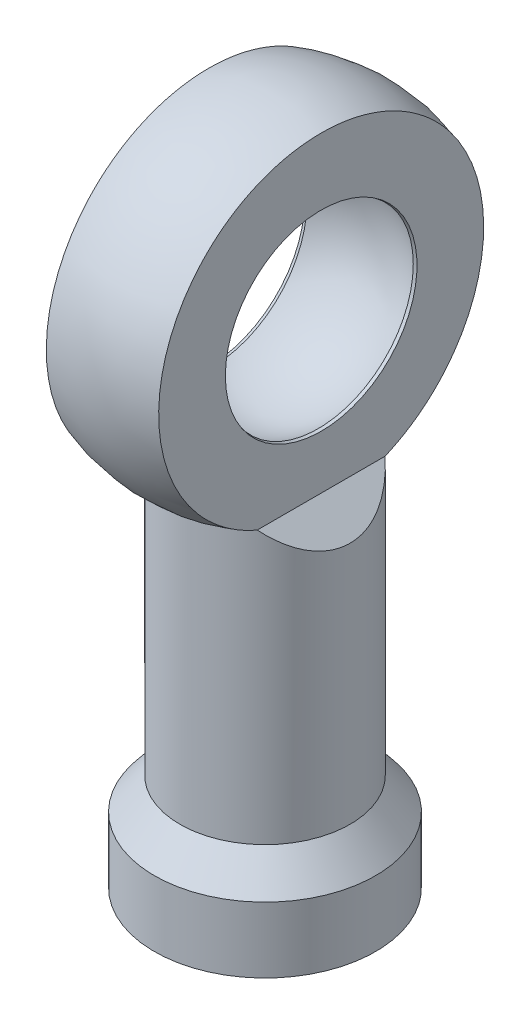
ISO-10303-21;
HEADER;
FILE_DESCRIPTION(('STEP AP214'),'2;1');
FILE_NAME('part.step','',(''),(''),'','','');
FILE_SCHEMA(('AUTOMOTIVE_DESIGN { 1 0 10303 214 1 1 1 1 }'));
ENDSEC;
DATA;
#1=APPLICATION_CONTEXT('core data for automotive mechanical design processes');
#2=APPLICATION_PROTOCOL_DEFINITION('international standard','automotive_design',2000,#1);
#3=PRODUCT_CONTEXT('',#1,'mechanical');
#4=PRODUCT('Part','Part','',(#3));
#5=PRODUCT_RELATED_PRODUCT_CATEGORY('part','',(#4));
#6=PRODUCT_DEFINITION_FORMATION('','',#4);
#7=PRODUCT_DEFINITION_CONTEXT('part definition',#1,'design');
#8=PRODUCT_DEFINITION('design','',#6,#7);
#9=PRODUCT_DEFINITION_SHAPE('','',#8);
#10=(LENGTH_UNIT() NAMED_UNIT(*) SI_UNIT(.MILLI.,.METRE.));
#11=(NAMED_UNIT(*) PLANE_ANGLE_UNIT() SI_UNIT($,.RADIAN.));
#12=(NAMED_UNIT(*) SI_UNIT($,.STERADIAN.) SOLID_ANGLE_UNIT());
#13=UNCERTAINTY_MEASURE_WITH_UNIT(LENGTH_MEASURE(1.E-05),#10,'distance_accuracy_value','');
#14=(GEOMETRIC_REPRESENTATION_CONTEXT(3) GLOBAL_UNCERTAINTY_ASSIGNED_CONTEXT((#13)) GLOBAL_UNIT_ASSIGNED_CONTEXT((#10,
#11,#12)) REPRESENTATION_CONTEXT('',''));
#15=CARTESIAN_POINT('',(0.,0.,0.));
#16=DIRECTION('',(0.,0.,1.));
#17=DIRECTION('',(1.,0.,0.));
#18=AXIS2_PLACEMENT_3D('',#15,#16,#17);
#19=CARTESIAN_POINT('',(0.,0.,0.));
#20=DIRECTION('',(0.,1.,0.));
#21=DIRECTION('',(1.,0.,0.));
#22=AXIS2_PLACEMENT_3D('',#19,#20,#21);
#23=SPHERICAL_SURFACE('',#22,10.1);
#24=CARTESIAN_POINT('',(-3.3,0.,0.));
#25=DIRECTION('',(1.,0.,0.));
#26=DIRECTION('',(0.,0.,-1.));
#27=AXIS2_PLACEMENT_3D('',#24,#25,#26);
#28=CIRCLE('',#27,9.54567965102538);
#29=CARTESIAN_POINT('',(-3.3,-8.77553417177553,3.75632799419859));
#30=VERTEX_POINT('',#29);
#31=CARTESIAN_POINT('',(-3.3,-8.77553417177553,-3.75632799419859));
#32=VERTEX_POINT('',#31);
#33=EDGE_CURVE('E74',#30,#32,#28,.F.);
#34=ORIENTED_EDGE('',*,*,#33,.F.);
#35=CARTESIAN_POINT('',(0.,-8.77553417177553,0.));
#36=DIRECTION('',(0.,1.,0.));
#37=DIRECTION('',(-1.,0.,0.));
#38=AXIS2_PLACEMENT_3D('',#35,#36,#37);
#39=CIRCLE('',#38,5.);
#40=CARTESIAN_POINT('',(3.3,-8.77553417177553,3.75632799419859));
#41=VERTEX_POINT('',#40);
#42=EDGE_CURVE('E57',#30,#41,#39,.T.);
#43=ORIENTED_EDGE('',*,*,#42,.T.);
#44=CARTESIAN_POINT('',(3.3,0.,0.));
#45=DIRECTION('',(-1.,0.,0.));
#46=DIRECTION('',(0.,0.,1.));
#47=AXIS2_PLACEMENT_3D('',#44,#45,#46);
#48=CIRCLE('',#47,9.54567965102538);
#49=CARTESIAN_POINT('',(3.3,-8.77553417177553,-3.75632799419859));
#50=VERTEX_POINT('',#49);
#51=EDGE_CURVE('E152',#50,#41,#48,.F.);
#52=ORIENTED_EDGE('',*,*,#51,.F.);
#53=EDGE_CURVE('E77',#50,#32,#39,.T.);
#54=ORIENTED_EDGE('',*,*,#53,.T.);
#55=EDGE_LOOP('',(#34,#43,#52,#54));
#56=FACE_BOUND('',#55,.T.);
#57=ADVANCED_FACE('F35',(#56),#23,.T.);
#58=CARTESIAN_POINT('',(0.,-6.4,0.));
#59=DIRECTION('',(0.,1.,0.));
#60=DIRECTION('',(-1.,0.,0.));
#61=AXIS2_PLACEMENT_3D('',#58,#59,#60);
#62=CYLINDRICAL_SURFACE('',#61,5.);
#63=CARTESIAN_POINT('',(0.,-5.47553417177553,0.));
#64=DIRECTION('',(0.707106781186547,-0.707106781186548,0.));
#65=DIRECTION('',(0.707106781186548,0.707106781186547,0.));
#66=AXIS2_PLACEMENT_3D('',#63,#64,#65);
#67=ELLIPSE('',#66,7.07106781186547,5.);
#68=EDGE_CURVE('E64',#32,#30,#67,.F.);
#69=ORIENTED_EDGE('',*,*,#68,.F.);
#70=ORIENTED_EDGE('',*,*,#53,.F.);
#71=CARTESIAN_POINT('',(0.,-5.47553417177553,0.));
#72=DIRECTION('',(-0.707106781186547,-0.707106781186548,0.));
#73=DIRECTION('',(-0.707106781186548,0.707106781186547,0.));
#74=AXIS2_PLACEMENT_3D('',#71,#72,#73);
#75=ELLIPSE('',#74,7.07106781186547,5.);
#76=EDGE_CURVE('E70',#41,#50,#75,.F.);
#77=ORIENTED_EDGE('',*,*,#76,.F.);
#78=ORIENTED_EDGE('',*,*,#42,.F.);
#79=EDGE_LOOP('',(#69,#70,#77,#78));
#80=FACE_BOUND('',#79,.T.);
#81=CARTESIAN_POINT('',(0.,-24.7755341717755,0.));
#82=DIRECTION('',(0.,1.,0.));
#83=DIRECTION('',(-1.,0.,0.));
#84=AXIS2_PLACEMENT_3D('',#81,#82,#83);
#85=CIRCLE('',#84,5.);
#86=CARTESIAN_POINT('',(-4.99999999999999,-24.7755341717755,0.));
#87=VERTEX_POINT('',#86);
#88=EDGE_CURVE('E83',#87,#87,#85,.T.);
#89=ORIENTED_EDGE('',*,*,#88,.T.);
#90=EDGE_LOOP('',(#89));
#91=FACE_BOUND('',#90,.T.);
#92=ADVANCED_FACE('F81',(#80,#91),#62,.T.);
#93=CARTESIAN_POINT('',(0.,-24.7755341717755,0.));
#94=DIRECTION('',(0.,-1.,0.));
#95=DIRECTION('',(1.,0.,0.));
#96=AXIS2_PLACEMENT_3D('',#93,#94,#95);
#97=CONICAL_SURFACE('',#96,5.,0.677983114426302);
#98=CARTESIAN_POINT('',(0.,-26.6381223305397,0.));
#99=DIRECTION('',(0.,1.,0.));
#100=DIRECTION('',(-1.,0.,0.));
#101=AXIS2_PLACEMENT_3D('',#98,#99,#100);
#102=CIRCLE('',#101,6.5);
#103=CARTESIAN_POINT('',(-6.49999999999999,-26.6381223305397,0.));
#104=VERTEX_POINT('',#103);
#105=EDGE_CURVE('E86',#104,#104,#102,.T.);
#106=ORIENTED_EDGE('',*,*,#105,.T.);
#107=EDGE_LOOP('',(#106));
#108=FACE_BOUND('',#107,.T.);
#109=ORIENTED_EDGE('',*,*,#88,.F.);
#110=EDGE_LOOP('',(#109));
#111=FACE_BOUND('',#110,.T.);
#112=ADVANCED_FACE('F129',(#108,#111),#97,.T.);
#113=CARTESIAN_POINT('',(0.,-6.4,0.));
#114=DIRECTION('',(0.,1.,0.));
#115=DIRECTION('',(-1.,0.,0.));
#116=AXIS2_PLACEMENT_3D('',#113,#114,#115);
#117=CYLINDRICAL_SURFACE('',#116,6.5);
#118=CARTESIAN_POINT('',(0.,-30.5,0.));
#119=DIRECTION('',(0.,1.,0.));
#120=DIRECTION('',(-1.,0.,0.));
#121=AXIS2_PLACEMENT_3D('',#118,#119,#120);
#122=CIRCLE('',#121,6.5);
#123=CARTESIAN_POINT('',(-6.49999999999999,-30.5,0.));
#124=VERTEX_POINT('',#123);
#125=EDGE_CURVE('E155',#124,#124,#122,.T.);
#126=ORIENTED_EDGE('',*,*,#125,.T.);
#127=EDGE_LOOP('',(#126));
#128=FACE_BOUND('',#127,.T.);
#129=ORIENTED_EDGE('',*,*,#105,.F.);
#130=EDGE_LOOP('',(#129));
#131=FACE_BOUND('',#130,.T.);
#132=ADVANCED_FACE('F162',(#128,#131),#117,.T.);
#133=CARTESIAN_POINT('',(-6.49999999999999,-30.5,0.));
#134=DIRECTION('',(0.,-1.,0.));
#135=DIRECTION('',(1.,0.,0.));
#136=AXIS2_PLACEMENT_3D('',#133,#134,#135);
#137=PLANE('',#136);
#138=CARTESIAN_POINT('',(0.,-30.5,0.));
#139=DIRECTION('',(0.,-1.,0.));
#140=DIRECTION('',(1.,0.,0.));
#141=AXIS2_PLACEMENT_3D('',#138,#139,#140);
#142=CIRCLE('',#141,3.3);
#143=CARTESIAN_POINT('',(3.30000000000001,-30.5,0.));
#144=VERTEX_POINT('',#143);
#145=EDGE_CURVE('E93',#144,#144,#142,.F.);
#146=ORIENTED_EDGE('',*,*,#145,.T.);
#147=EDGE_LOOP('',(#146));
#148=FACE_BOUND('',#147,.T.);
#149=ORIENTED_EDGE('',*,*,#125,.F.);
#150=EDGE_LOOP('',(#149));
#151=FACE_BOUND('',#150,.T.);
#152=ADVANCED_FACE('F164',(#148,#151),#137,.T.);
#153=CARTESIAN_POINT('',(6.3,-11.7755341717755,-10.1));
#154=DIRECTION('',(-0.707106781186547,-0.707106781186548,0.));
#155=DIRECTION('',(0.707106781186548,-0.707106781186547,0.));
#156=AXIS2_PLACEMENT_3D('',#153,#154,#155);
#157=PLANE('',#156);
#158=ORIENTED_EDGE('',*,*,#76,.T.);
#159=DIRECTION('',(0.,0.,1.));
#160=VECTOR('',#159,1.);
#161=CARTESIAN_POINT('',(3.3,-8.77553417177553,-10.1));
#162=LINE('',#161,#160);
#163=EDGE_CURVE('E78',#50,#41,#162,.T.);
#164=ORIENTED_EDGE('',*,*,#163,.T.);
#165=EDGE_LOOP('',(#158,#164));
#166=FACE_BOUND('',#165,.T.);
#167=ADVANCED_FACE('F171',(#166),#157,.F.);
#168=CARTESIAN_POINT('',(3.3,-8.77553417177553,-10.1));
#169=DIRECTION('',(-1.,0.,0.));
#170=DIRECTION('',(0.,0.,1.));
#171=AXIS2_PLACEMENT_3D('',#168,#169,#170);
#172=PLANE('',#171);
#173=CARTESIAN_POINT('',(3.3,0.,0.));
#174=DIRECTION('',(-1.,0.,0.));
#175=DIRECTION('',(0.,0.,1.));
#176=AXIS2_PLACEMENT_3D('',#173,#174,#175);
#177=CIRCLE('',#176,5.62933787607294);
#178=CARTESIAN_POINT('',(3.3,0.,5.62933787607294));
#179=VERTEX_POINT('',#178);
#180=EDGE_CURVE('E11',#179,#179,#177,.T.);
#181=ORIENTED_EDGE('',*,*,#180,.T.);
#182=EDGE_LOOP('',(#181));
#183=FACE_BOUND('',#182,.T.);
#184=ORIENTED_EDGE('',*,*,#51,.T.);
#185=ORIENTED_EDGE('',*,*,#163,.F.);
#186=EDGE_LOOP('',(#184,#185));
#187=FACE_BOUND('',#186,.T.);
#188=ADVANCED_FACE('F135',(#183,#187),#172,.F.);
#189=CARTESIAN_POINT('',(0.,0.,0.));
#190=DIRECTION('',(0.,1.,0.));
#191=DIRECTION('',(-1.,0.,0.));
#192=AXIS2_PLACEMENT_3D('',#189,#190,#191);
#193=SPHERICAL_SURFACE('',#192,6.4);
#194=CARTESIAN_POINT('',(0.,0.,0.));
#195=DIRECTION('',(1.,0.,0.));
#196=DIRECTION('',(0.,0.,-1.));
#197=AXIS2_PLACEMENT_3D('',#194,#195,#196);
#198=SPHERICAL_SURFACE('',#197,6.4);
#199=CARTESIAN_POINT('',(-3.1242075970037,0.,0.));
#200=DIRECTION('',(1.,0.,0.));
#201=DIRECTION('',(0.,0.,-1.));
#202=AXIS2_PLACEMENT_3D('',#199,#200,#201);
#203=CIRCLE('',#202,5.58563576424604);
#204=CARTESIAN_POINT('',(-3.1242075970037,0.,-5.58563576424604));
#205=VERTEX_POINT('',#204);
#206=EDGE_CURVE('E43',#205,#205,#203,.F.);
#207=ORIENTED_EDGE('',*,*,#206,.T.);
#208=EDGE_LOOP('',(#207));
#209=FACE_BOUND('',#208,.T.);
#210=CARTESIAN_POINT('',(3.12420759700368,0.,0.));
#211=DIRECTION('',(-1.,0.,0.));
#212=DIRECTION('',(0.,0.,1.));
#213=AXIS2_PLACEMENT_3D('',#210,#211,#212);
#214=CIRCLE('',#213,5.58563576424604);
#215=CARTESIAN_POINT('',(3.12420759700368,0.,5.58563576424604));
#216=VERTEX_POINT('',#215);
#217=EDGE_CURVE('E99',#216,#216,#214,.F.);
#218=ORIENTED_EDGE('',*,*,#217,.T.);
#219=EDGE_LOOP('',(#218));
#220=FACE_BOUND('',#219,.T.);
#221=ADVANCED_FACE('F104',(#209,#220),#198,.F.);
#222=CARTESIAN_POINT('',(-6.3,-11.7755341717755,-10.1));
#223=DIRECTION('',(0.707106781186547,-0.707106781186548,0.));
#224=DIRECTION('',(0.707106781186548,0.707106781186547,0.));
#225=AXIS2_PLACEMENT_3D('',#222,#223,#224);
#226=PLANE('',#225);
#227=ORIENTED_EDGE('',*,*,#68,.T.);
#228=DIRECTION('',(0.,0.,1.));
#229=VECTOR('',#228,1.);
#230=CARTESIAN_POINT('',(-3.3,-8.77553417177553,-10.1));
#231=LINE('',#230,#229);
#232=EDGE_CURVE('E49',#32,#30,#231,.T.);
#233=ORIENTED_EDGE('',*,*,#232,.F.);
#234=EDGE_LOOP('',(#227,#233));
#235=FACE_BOUND('',#234,.T.);
#236=ADVANCED_FACE('F65',(#235),#226,.F.);
#237=CARTESIAN_POINT('',(-3.3,-8.77553417177553,-10.1));
#238=DIRECTION('',(1.,0.,0.));
#239=DIRECTION('',(0.,0.,-1.));
#240=AXIS2_PLACEMENT_3D('',#237,#238,#239);
#241=PLANE('',#240);
#242=CARTESIAN_POINT('',(-3.3,0.,0.));
#243=DIRECTION('',(1.,0.,0.));
#244=DIRECTION('',(0.,0.,-1.));
#245=AXIS2_PLACEMENT_3D('',#242,#243,#244);
#246=CIRCLE('',#245,5.62933787607293);
#247=CARTESIAN_POINT('',(-3.3,0.,-5.62933787607293));
#248=VERTEX_POINT('',#247);
#249=EDGE_CURVE('E96',#248,#248,#246,.T.);
#250=ORIENTED_EDGE('',*,*,#249,.T.);
#251=EDGE_LOOP('',(#250));
#252=FACE_BOUND('',#251,.T.);
#253=ORIENTED_EDGE('',*,*,#33,.T.);
#254=ORIENTED_EDGE('',*,*,#232,.T.);
#255=EDGE_LOOP('',(#253,#254));
#256=FACE_BOUND('',#255,.T.);
#257=ADVANCED_FACE('F73',(#252,#256),#241,.F.);
#258=CARTESIAN_POINT('',(0.,-8.5,0.));
#259=DIRECTION('',(0.,-1.,0.));
#260=DIRECTION('',(1.,0.,0.));
#261=AXIS2_PLACEMENT_3D('',#258,#259,#260);
#262=CYLINDRICAL_SURFACE('',#261,3.);
#263=CARTESIAN_POINT('',(0.,-30.2,0.));
#264=DIRECTION('',(0.,-1.,0.));
#265=DIRECTION('',(1.,0.,0.));
#266=AXIS2_PLACEMENT_3D('',#263,#264,#265);
#267=CIRCLE('',#266,3.);
#268=CARTESIAN_POINT('',(3.00000000000001,-30.2,0.));
#269=VERTEX_POINT('',#268);
#270=EDGE_CURVE('E69',#269,#269,#267,.T.);
#271=ORIENTED_EDGE('',*,*,#270,.T.);
#272=EDGE_LOOP('',(#271));
#273=FACE_BOUND('',#272,.T.);
#274=CARTESIAN_POINT('',(0.,-8.5,0.));
#275=DIRECTION('',(0.,-1.,0.));
#276=DIRECTION('',(1.,0.,0.));
#277=AXIS2_PLACEMENT_3D('',#274,#275,#276);
#278=CIRCLE('',#277,3.);
#279=CARTESIAN_POINT('',(3.,-8.5,0.));
#280=VERTEX_POINT('',#279);
#281=EDGE_CURVE('E75',#280,#280,#278,.T.);
#282=ORIENTED_EDGE('',*,*,#281,.F.);
#283=EDGE_LOOP('',(#282));
#284=FACE_BOUND('',#283,.T.);
#285=ADVANCED_FACE('F114',(#273,#284),#262,.F.);
#286=CARTESIAN_POINT('',(0.,-8.5,0.));
#287=DIRECTION('',(0.,-1.,0.));
#288=DIRECTION('',(1.,0.,0.));
#289=AXIS2_PLACEMENT_3D('',#286,#287,#288);
#290=PLANE('',#289);
#291=ORIENTED_EDGE('',*,*,#281,.T.);
#292=EDGE_LOOP('',(#291));
#293=FACE_BOUND('',#292,.T.);
#294=ADVANCED_FACE('F120',(#293),#290,.T.);
#295=CARTESIAN_POINT('',(0.,-30.2,0.));
#296=DIRECTION('',(0.,-1.,0.));
#297=DIRECTION('',(1.,0.,0.));
#298=AXIS2_PLACEMENT_3D('',#295,#296,#297);
#299=TOROIDAL_SURFACE('',#298,3.3,0.3);
#300=ORIENTED_EDGE('',*,*,#145,.F.);
#301=EDGE_LOOP('',(#300));
#302=FACE_BOUND('',#301,.T.);
#303=ORIENTED_EDGE('',*,*,#270,.F.);
#304=EDGE_LOOP('',(#303));
#305=FACE_BOUND('',#304,.T.);
#306=ADVANCED_FACE('F110',(#302,#305),#299,.T.);
#307=CARTESIAN_POINT('',(-3.3,0.,0.));
#308=DIRECTION('',(-1.,0.,0.));
#309=DIRECTION('',(0.,0.,1.));
#310=AXIS2_PLACEMENT_3D('',#307,#308,#309);
#311=CONICAL_SURFACE('',#310,5.62933787607293,0.243661227899248);
#312=ORIENTED_EDGE('',*,*,#206,.F.);
#313=EDGE_LOOP('',(#312));
#314=FACE_BOUND('',#313,.T.);
#315=ORIENTED_EDGE('',*,*,#249,.F.);
#316=EDGE_LOOP('',(#315));
#317=FACE_BOUND('',#316,.T.);
#318=ADVANCED_FACE('F107',(#314,#317),#311,.F.);
#319=CARTESIAN_POINT('',(3.3,0.,0.));
#320=DIRECTION('',(1.,0.,0.));
#321=DIRECTION('',(0.,0.,-1.));
#322=AXIS2_PLACEMENT_3D('',#319,#320,#321);
#323=CONICAL_SURFACE('',#322,5.62933787607294,0.243661227899243);
#324=ORIENTED_EDGE('',*,*,#217,.F.);
#325=EDGE_LOOP('',(#324));
#326=FACE_BOUND('',#325,.T.);
#327=ORIENTED_EDGE('',*,*,#180,.F.);
#328=EDGE_LOOP('',(#327));
#329=FACE_BOUND('',#328,.T.);
#330=ADVANCED_FACE('F37',(#326,#329),#323,.F.);
#331=CLOSED_SHELL('',(#57,#92,#112,#132,#152,#167,#188,#221,#236,#257,#285,#294,#306,#318,#330));
#332=MANIFOLD_SOLID_BREP('B2',#331);
#333=ADVANCED_BREP_SHAPE_REPRESENTATION('',(#18,#332),#14);
#334=SHAPE_DEFINITION_REPRESENTATION(#9,#333);
ENDSEC;
END-ISO-10303-21;
